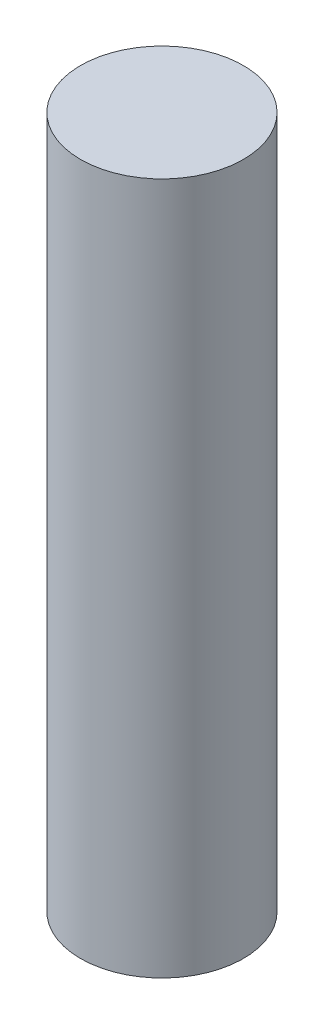
ISO-10303-21;
HEADER;
FILE_DESCRIPTION(('STEP AP214'),'2;1');
FILE_NAME('part.step','',(''),(''),'','','');
FILE_SCHEMA(('AUTOMOTIVE_DESIGN { 1 0 10303 214 1 1 1 1 }'));
ENDSEC;
DATA;
#1=APPLICATION_CONTEXT('core data for automotive mechanical design processes');
#2=APPLICATION_PROTOCOL_DEFINITION('international standard','automotive_design',2000,#1);
#3=PRODUCT_CONTEXT('',#1,'mechanical');
#4=PRODUCT('Part','Part','',(#3));
#5=PRODUCT_RELATED_PRODUCT_CATEGORY('part','',(#4));
#6=PRODUCT_DEFINITION_FORMATION('','',#4);
#7=PRODUCT_DEFINITION_CONTEXT('part definition',#1,'design');
#8=PRODUCT_DEFINITION('design','',#6,#7);
#9=PRODUCT_DEFINITION_SHAPE('','',#8);
#10=(LENGTH_UNIT() NAMED_UNIT(*) SI_UNIT(.MILLI.,.METRE.));
#11=(NAMED_UNIT(*) PLANE_ANGLE_UNIT() SI_UNIT($,.RADIAN.));
#12=(NAMED_UNIT(*) SI_UNIT($,.STERADIAN.) SOLID_ANGLE_UNIT());
#13=UNCERTAINTY_MEASURE_WITH_UNIT(LENGTH_MEASURE(1.E-05),#10,'distance_accuracy_value','');
#14=(GEOMETRIC_REPRESENTATION_CONTEXT(3) GLOBAL_UNCERTAINTY_ASSIGNED_CONTEXT((#13)) GLOBAL_UNIT_ASSIGNED_CONTEXT((#10,
#11,#12)) REPRESENTATION_CONTEXT('',''));
#15=CARTESIAN_POINT('',(0.,0.,0.));
#16=DIRECTION('',(0.,0.,1.));
#17=DIRECTION('',(1.,0.,0.));
#18=AXIS2_PLACEMENT_3D('',#15,#16,#17);
#19=CARTESIAN_POINT('',(0.,170.,0.));
#20=DIRECTION('',(0.,-1.,0.));
#21=DIRECTION('',(0.,0.,-1.));
#22=AXIS2_PLACEMENT_3D('',#19,#20,#21);
#23=CYLINDRICAL_SURFACE('',#22,20.);
#24=CARTESIAN_POINT('',(0.,170.,0.));
#25=DIRECTION('',(0.,1.,0.));
#26=DIRECTION('',(0.,0.,1.));
#27=AXIS2_PLACEMENT_3D('',#24,#25,#26);
#28=CIRCLE('',#27,20.);
#29=CARTESIAN_POINT('',(0.,170.,20.));
#30=VERTEX_POINT('',#29);
#31=EDGE_CURVE('E10',#30,#30,#28,.T.);
#32=ORIENTED_EDGE('',*,*,#31,.F.);
#33=EDGE_LOOP('',(#32));
#34=FACE_BOUND('',#33,.T.);
#35=CARTESIAN_POINT('',(0.,0.,0.));
#36=DIRECTION('',(0.,1.,0.));
#37=DIRECTION('',(0.,0.,1.));
#38=AXIS2_PLACEMENT_3D('',#35,#36,#37);
#39=CIRCLE('',#38,20.);
#40=CARTESIAN_POINT('',(0.,0.,20.));
#41=VERTEX_POINT('',#40);
#42=EDGE_CURVE('E35',#41,#41,#39,.T.);
#43=ORIENTED_EDGE('',*,*,#42,.T.);
#44=EDGE_LOOP('',(#43));
#45=FACE_BOUND('',#44,.T.);
#46=ADVANCED_FACE('F32',(#34,#45),#23,.T.);
#47=CARTESIAN_POINT('',(0.,170.,0.));
#48=DIRECTION('',(0.,1.,0.));
#49=DIRECTION('',(0.,0.,1.));
#50=AXIS2_PLACEMENT_3D('',#47,#48,#49);
#51=PLANE('',#50);
#52=ORIENTED_EDGE('',*,*,#31,.T.);
#53=EDGE_LOOP('',(#52));
#54=FACE_BOUND('',#53,.T.);
#55=ADVANCED_FACE('F47',(#54),#51,.T.);
#56=CARTESIAN_POINT('',(0.,0.,0.));
#57=DIRECTION('',(0.,1.,0.));
#58=DIRECTION('',(0.,0.,1.));
#59=AXIS2_PLACEMENT_3D('',#56,#57,#58);
#60=PLANE('',#59);
#61=ORIENTED_EDGE('',*,*,#42,.F.);
#62=EDGE_LOOP('',(#61));
#63=FACE_BOUND('',#62,.T.);
#64=ADVANCED_FACE('F45',(#63),#60,.F.);
#65=CLOSED_SHELL('',(#46,#55,#64));
#66=MANIFOLD_SOLID_BREP('B2',#65);
#67=ADVANCED_BREP_SHAPE_REPRESENTATION('',(#18,#66),#14);
#68=SHAPE_DEFINITION_REPRESENTATION(#9,#67);
ENDSEC;
END-ISO-10303-21;
